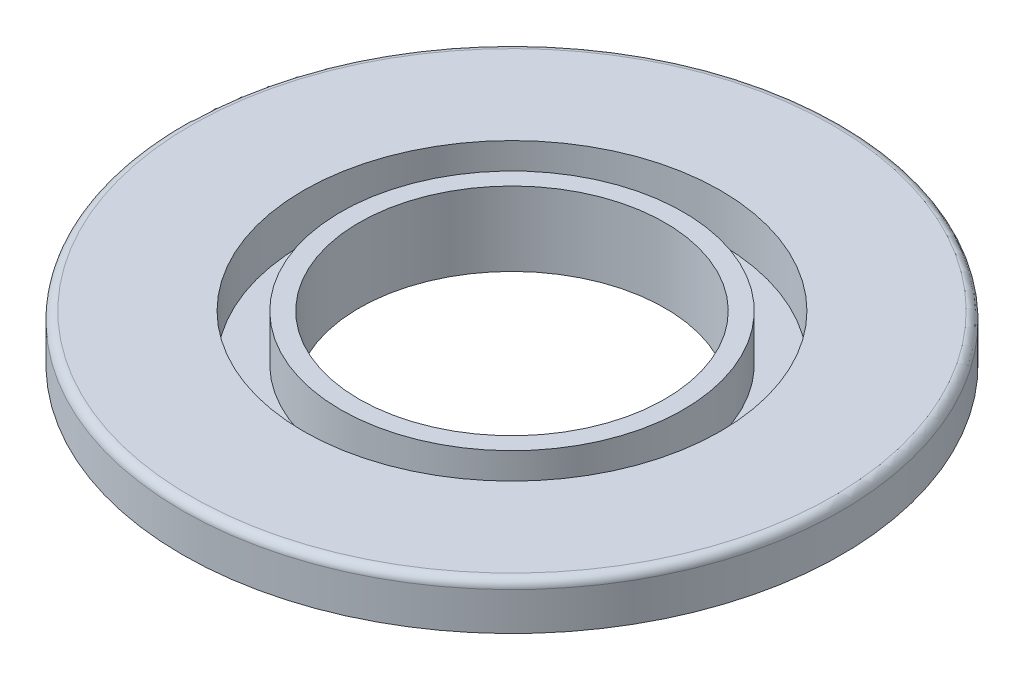
ISO-10303-21;
HEADER;
FILE_DESCRIPTION(('STEP AP214'),'2;1');
FILE_NAME('part.step','',(''),(''),'','','');
FILE_SCHEMA(('AUTOMOTIVE_DESIGN { 1 0 10303 214 1 1 1 1 }'));
ENDSEC;
DATA;
#1=APPLICATION_CONTEXT('core data for automotive mechanical design processes');
#2=APPLICATION_PROTOCOL_DEFINITION('international standard','automotive_design',2000,#1);
#3=PRODUCT_CONTEXT('',#1,'mechanical');
#4=PRODUCT('Part','Part','',(#3));
#5=PRODUCT_RELATED_PRODUCT_CATEGORY('part','',(#4));
#6=PRODUCT_DEFINITION_FORMATION('','',#4);
#7=PRODUCT_DEFINITION_CONTEXT('part definition',#1,'design');
#8=PRODUCT_DEFINITION('design','',#6,#7);
#9=PRODUCT_DEFINITION_SHAPE('','',#8);
#10=(LENGTH_UNIT() NAMED_UNIT(*) SI_UNIT(.MILLI.,.METRE.));
#11=(NAMED_UNIT(*) PLANE_ANGLE_UNIT() SI_UNIT($,.RADIAN.));
#12=(NAMED_UNIT(*) SI_UNIT($,.STERADIAN.) SOLID_ANGLE_UNIT());
#13=UNCERTAINTY_MEASURE_WITH_UNIT(LENGTH_MEASURE(1.E-05),#10,'distance_accuracy_value','');
#14=(GEOMETRIC_REPRESENTATION_CONTEXT(3) GLOBAL_UNCERTAINTY_ASSIGNED_CONTEXT((#13)) GLOBAL_UNIT_ASSIGNED_CONTEXT((#10,
#11,#12)) REPRESENTATION_CONTEXT('',''));
#15=CARTESIAN_POINT('',(0.,0.,0.));
#16=DIRECTION('',(0.,0.,1.));
#17=DIRECTION('',(1.,0.,0.));
#18=AXIS2_PLACEMENT_3D('',#15,#16,#17);
#19=CARTESIAN_POINT('',(-23.866050786552,40.6568697319389,0.));
#20=DIRECTION('',(0.,1.,0.));
#21=DIRECTION('',(0.,0.,1.));
#22=AXIS2_PLACEMENT_3D('',#19,#20,#21);
#23=CYLINDRICAL_SURFACE('',#22,47.9696878858064);
#24=CARTESIAN_POINT('',(-23.866050786552,31.2414300017496,0.));
#25=DIRECTION('',(0.,1.,0.));
#26=DIRECTION('',(0.,0.,1.));
#27=AXIS2_PLACEMENT_3D('',#24,#25,#26);
#28=CIRCLE('',#27,47.9696878858064);
#29=CARTESIAN_POINT('',(-23.866050786552,31.2414300017496,47.9696878858064));
#30=VERTEX_POINT('',#29);
#31=EDGE_CURVE('E107',#30,#30,#28,.T.);
#32=ORIENTED_EDGE('',*,*,#31,.F.);
#33=EDGE_LOOP('',(#32));
#34=FACE_BOUND('',#33,.T.);
#35=CARTESIAN_POINT('',(-23.866050786552,25.6578552780326,0.));
#36=DIRECTION('',(0.,1.,0.));
#37=DIRECTION('',(0.,0.,1.));
#38=AXIS2_PLACEMENT_3D('',#35,#36,#37);
#39=CIRCLE('',#38,47.9696878858064);
#40=CARTESIAN_POINT('',(-23.866050786552,25.6578552780326,47.9696878858064));
#41=VERTEX_POINT('',#40);
#42=EDGE_CURVE('E63',#41,#41,#39,.T.);
#43=ORIENTED_EDGE('',*,*,#42,.T.);
#44=EDGE_LOOP('',(#43));
#45=FACE_BOUND('',#44,.T.);
#46=ADVANCED_FACE('F39',(#34,#45),#23,.T.);
#47=CARTESIAN_POINT('',(0.,25.6578552780326,0.));
#48=DIRECTION('',(0.,1.,0.));
#49=DIRECTION('',(0.,0.,1.));
#50=AXIS2_PLACEMENT_3D('',#47,#48,#49);
#51=PLANE('',#50);
#52=ORIENTED_EDGE('',*,*,#42,.F.);
#53=EDGE_LOOP('',(#52));
#54=FACE_BOUND('',#53,.T.);
#55=CARTESIAN_POINT('',(-23.866050786552,25.6578552780326,0.));
#56=DIRECTION('',(0.,1.,0.));
#57=DIRECTION('',(0.,0.,1.));
#58=AXIS2_PLACEMENT_3D('',#55,#56,#57);
#59=CIRCLE('',#58,46.1084963112341);
#60=CARTESIAN_POINT('',(-23.866050786552,25.6578552780326,46.1084963112341));
#61=VERTEX_POINT('',#60);
#62=EDGE_CURVE('E67',#61,#61,#59,.T.);
#63=ORIENTED_EDGE('',*,*,#62,.T.);
#64=EDGE_LOOP('',(#63));
#65=FACE_BOUND('',#64,.T.);
#66=ADVANCED_FACE('F116',(#54,#65),#51,.F.);
#67=CARTESIAN_POINT('',(-23.866050786552,40.6568697319389,0.));
#68=DIRECTION('',(0.,1.,0.));
#69=DIRECTION('',(0.,0.,1.));
#70=AXIS2_PLACEMENT_3D('',#67,#68,#69);
#71=CYLINDRICAL_SURFACE('',#70,46.1084963112341);
#72=ORIENTED_EDGE('',*,*,#62,.F.);
#73=EDGE_LOOP('',(#72));
#74=FACE_BOUND('',#73,.T.);
#75=CARTESIAN_POINT('',(-23.866050786552,19.9647986969879,0.));
#76=DIRECTION('',(0.,1.,0.));
#77=DIRECTION('',(0.,0.,1.));
#78=AXIS2_PLACEMENT_3D('',#75,#76,#77);
#79=CIRCLE('',#78,46.1084963112341);
#80=CARTESIAN_POINT('',(-23.866050786552,19.9647986969879,46.1084963112341));
#81=VERTEX_POINT('',#80);
#82=EDGE_CURVE('E71',#81,#81,#79,.T.);
#83=ORIENTED_EDGE('',*,*,#82,.T.);
#84=EDGE_LOOP('',(#83));
#85=FACE_BOUND('',#84,.T.);
#86=ADVANCED_FACE('F122',(#74,#85),#71,.T.);
#87=CARTESIAN_POINT('',(0.,19.9647986969879,0.));
#88=DIRECTION('',(0.,1.,0.));
#89=DIRECTION('',(0.,0.,1.));
#90=AXIS2_PLACEMENT_3D('',#87,#88,#89);
#91=PLANE('',#90);
#92=ORIENTED_EDGE('',*,*,#82,.F.);
#93=EDGE_LOOP('',(#92));
#94=FACE_BOUND('',#93,.T.);
#95=CARTESIAN_POINT('',(-23.866050786552,19.9647986969879,0.));
#96=DIRECTION('',(0.,1.,0.));
#97=DIRECTION('',(0.,0.,1.));
#98=AXIS2_PLACEMENT_3D('',#95,#96,#97);
#99=CIRCLE('',#98,42.2766313047617);
#100=CARTESIAN_POINT('',(-23.866050786552,19.9647986969879,42.2766313047617));
#101=VERTEX_POINT('',#100);
#102=EDGE_CURVE('E75',#101,#101,#99,.T.);
#103=ORIENTED_EDGE('',*,*,#102,.T.);
#104=EDGE_LOOP('',(#103));
#105=FACE_BOUND('',#104,.T.);
#106=ADVANCED_FACE('F128',(#94,#105),#91,.F.);
#107=CARTESIAN_POINT('',(-23.866050786552,40.6568697319389,0.));
#108=DIRECTION('',(0.,1.,0.));
#109=DIRECTION('',(0.,0.,1.));
#110=AXIS2_PLACEMENT_3D('',#107,#108,#109);
#111=CYLINDRICAL_SURFACE('',#110,42.2766313047617);
#112=CARTESIAN_POINT('',(-23.866050786552,23.9578552780326,0.));
#113=DIRECTION('',(0.,1.,0.));
#114=DIRECTION('',(0.,0.,1.));
#115=AXIS2_PLACEMENT_3D('',#112,#113,#114);
#116=CIRCLE('',#115,42.2766313047617);
#117=CARTESIAN_POINT('',(-23.866050786552,23.9578552780326,42.2766313047617));
#118=VERTEX_POINT('',#117);
#119=EDGE_CURVE('E47',#118,#118,#116,.T.);
#120=ORIENTED_EDGE('',*,*,#119,.T.);
#121=EDGE_LOOP('',(#120));
#122=FACE_BOUND('',#121,.T.);
#123=ORIENTED_EDGE('',*,*,#102,.F.);
#124=EDGE_LOOP('',(#123));
#125=FACE_BOUND('',#124,.T.);
#126=ADVANCED_FACE('F134',(#122,#125),#111,.F.);
#127=CARTESIAN_POINT('',(0.,25.6578552780326,0.));
#128=DIRECTION('',(0.,1.,0.));
#129=DIRECTION('',(0.,0.,1.));
#130=AXIS2_PLACEMENT_3D('',#127,#128,#129);
#131=PLANE('',#130);
#132=CARTESIAN_POINT('',(-23.866050786552,25.6578552780326,0.));
#133=DIRECTION('',(0.,1.,0.));
#134=DIRECTION('',(0.,0.,1.));
#135=AXIS2_PLACEMENT_3D('',#132,#133,#134);
#136=CIRCLE('',#135,40.5766313047617);
#137=CARTESIAN_POINT('',(-23.866050786552,25.6578552780326,40.5766313047617));
#138=VERTEX_POINT('',#137);
#139=EDGE_CURVE('E10',#138,#138,#136,.F.);
#140=ORIENTED_EDGE('',*,*,#139,.T.);
#141=EDGE_LOOP('',(#140));
#142=FACE_BOUND('',#141,.T.);
#143=CARTESIAN_POINT('',(-23.866050786552,25.6578552780326,0.));
#144=DIRECTION('',(0.,1.,0.));
#145=DIRECTION('',(0.,0.,1.));
#146=AXIS2_PLACEMENT_3D('',#143,#144,#145);
#147=CIRCLE('',#146,31.);
#148=CARTESIAN_POINT('',(-23.866050786552,25.6578552780326,31.));
#149=VERTEX_POINT('',#148);
#150=EDGE_CURVE('E79',#149,#149,#147,.T.);
#151=ORIENTED_EDGE('',*,*,#150,.T.);
#152=EDGE_LOOP('',(#151));
#153=FACE_BOUND('',#152,.T.);
#154=ADVANCED_FACE('F139',(#142,#153),#131,.F.);
#155=CARTESIAN_POINT('',(-23.866050786552,40.6568697319389,0.));
#156=DIRECTION('',(0.,1.,0.));
#157=DIRECTION('',(0.,0.,1.));
#158=AXIS2_PLACEMENT_3D('',#155,#156,#157);
#159=CYLINDRICAL_SURFACE('',#158,31.);
#160=ORIENTED_EDGE('',*,*,#150,.F.);
#161=EDGE_LOOP('',(#160));
#162=FACE_BOUND('',#161,.T.);
#163=CARTESIAN_POINT('',(-23.866050786552,40.6568697319389,0.));
#164=DIRECTION('',(0.,1.,0.));
#165=DIRECTION('',(0.,0.,1.));
#166=AXIS2_PLACEMENT_3D('',#163,#164,#165);
#167=CIRCLE('',#166,31.);
#168=CARTESIAN_POINT('',(-23.866050786552,40.6568697319389,31.));
#169=VERTEX_POINT('',#168);
#170=EDGE_CURVE('E83',#169,#169,#167,.T.);
#171=ORIENTED_EDGE('',*,*,#170,.T.);
#172=EDGE_LOOP('',(#171));
#173=FACE_BOUND('',#172,.T.);
#174=ADVANCED_FACE('F144',(#162,#173),#159,.F.);
#175=CARTESIAN_POINT('',(0.,40.6568697319389,0.));
#176=DIRECTION('',(0.,-1.,0.));
#177=DIRECTION('',(0.,0.,-1.));
#178=AXIS2_PLACEMENT_3D('',#175,#176,#177);
#179=PLANE('',#178);
#180=ORIENTED_EDGE('',*,*,#170,.F.);
#181=EDGE_LOOP('',(#180));
#182=FACE_BOUND('',#181,.T.);
#183=CARTESIAN_POINT('',(-23.866050786552,40.6568697319389,0.));
#184=DIRECTION('',(0.,1.,0.));
#185=DIRECTION('',(0.,0.,1.));
#186=AXIS2_PLACEMENT_3D('',#183,#184,#185);
#187=CIRCLE('',#186,34.7223831491446);
#188=CARTESIAN_POINT('',(-23.866050786552,40.6568697319389,34.7223831491446));
#189=VERTEX_POINT('',#188);
#190=EDGE_CURVE('E87',#189,#189,#187,.T.);
#191=ORIENTED_EDGE('',*,*,#190,.T.);
#192=EDGE_LOOP('',(#191));
#193=FACE_BOUND('',#192,.T.);
#194=ADVANCED_FACE('F184',(#182,#193),#179,.F.);
#195=CARTESIAN_POINT('',(-23.866050786552,40.6568697319389,0.));
#196=DIRECTION('',(0.,1.,0.));
#197=DIRECTION('',(0.,0.,1.));
#198=AXIS2_PLACEMENT_3D('',#195,#196,#197);
#199=CYLINDRICAL_SURFACE('',#198,34.7223831491446);
#200=ORIENTED_EDGE('',*,*,#190,.F.);
#201=EDGE_LOOP('',(#200));
#202=FACE_BOUND('',#201,.T.);
#203=CARTESIAN_POINT('',(-23.866050786552,31.2414300017496,0.));
#204=DIRECTION('',(0.,1.,0.));
#205=DIRECTION('',(0.,0.,1.));
#206=AXIS2_PLACEMENT_3D('',#203,#204,#205);
#207=CIRCLE('',#206,34.7223831491446);
#208=CARTESIAN_POINT('',(-23.866050786552,31.2414300017496,34.7223831491446));
#209=VERTEX_POINT('',#208);
#210=EDGE_CURVE('E91',#209,#209,#207,.T.);
#211=ORIENTED_EDGE('',*,*,#210,.T.);
#212=EDGE_LOOP('',(#211));
#213=FACE_BOUND('',#212,.T.);
#214=ADVANCED_FACE('F176',(#202,#213),#199,.T.);
#215=CARTESIAN_POINT('',(0.,31.2414300017496,0.));
#216=DIRECTION('',(0.,-1.,0.));
#217=DIRECTION('',(0.,0.,-1.));
#218=AXIS2_PLACEMENT_3D('',#215,#216,#217);
#219=PLANE('',#218);
#220=ORIENTED_EDGE('',*,*,#210,.F.);
#221=EDGE_LOOP('',(#220));
#222=FACE_BOUND('',#221,.T.);
#223=CARTESIAN_POINT('',(-23.866050786552,31.2414300017496,0.));
#224=DIRECTION('',(0.,1.,0.));
#225=DIRECTION('',(0.,0.,1.));
#226=AXIS2_PLACEMENT_3D('',#223,#224,#225);
#227=CIRCLE('',#226,42.2766313047617);
#228=CARTESIAN_POINT('',(-23.866050786552,31.2414300017496,42.2766313047617));
#229=VERTEX_POINT('',#228);
#230=EDGE_CURVE('E95',#229,#229,#227,.T.);
#231=ORIENTED_EDGE('',*,*,#230,.T.);
#232=EDGE_LOOP('',(#231));
#233=FACE_BOUND('',#232,.T.);
#234=ADVANCED_FACE('F170',(#222,#233),#219,.F.);
#235=CARTESIAN_POINT('',(-23.866050786552,40.6568697319389,0.));
#236=DIRECTION('',(0.,1.,0.));
#237=DIRECTION('',(0.,0.,1.));
#238=AXIS2_PLACEMENT_3D('',#235,#236,#237);
#239=CYLINDRICAL_SURFACE('',#238,42.2766313047617);
#240=ORIENTED_EDGE('',*,*,#230,.F.);
#241=EDGE_LOOP('',(#240));
#242=FACE_BOUND('',#241,.T.);
#243=CARTESIAN_POINT('',(-23.866050786552,40.6568697319389,0.));
#244=DIRECTION('',(0.,1.,0.));
#245=DIRECTION('',(0.,0.,1.));
#246=AXIS2_PLACEMENT_3D('',#243,#244,#245);
#247=CIRCLE('',#246,42.2766313047617);
#248=CARTESIAN_POINT('',(-23.866050786552,40.6568697319389,42.2766313047617));
#249=VERTEX_POINT('',#248);
#250=EDGE_CURVE('E99',#249,#249,#247,.T.);
#251=ORIENTED_EDGE('',*,*,#250,.T.);
#252=EDGE_LOOP('',(#251));
#253=FACE_BOUND('',#252,.T.);
#254=ADVANCED_FACE('F165',(#242,#253),#239,.F.);
#255=CARTESIAN_POINT('',(0.,40.6568697319389,0.));
#256=DIRECTION('',(0.,-1.,0.));
#257=DIRECTION('',(0.,0.,-1.));
#258=AXIS2_PLACEMENT_3D('',#255,#256,#257);
#259=PLANE('',#258);
#260=CARTESIAN_POINT('',(-23.866050786552,40.6568697319389,0.));
#261=DIRECTION('',(0.,-1.,0.));
#262=DIRECTION('',(0.,0.,-1.));
#263=AXIS2_PLACEMENT_3D('',#260,#261,#262);
#264=CIRCLE('',#263,65.1005673461851);
#265=CARTESIAN_POINT('',(-23.866050786552,40.6568697319389,-65.1005673461851));
#266=VERTEX_POINT('',#265);
#267=EDGE_CURVE('E57',#266,#266,#264,.F.);
#268=ORIENTED_EDGE('',*,*,#267,.T.);
#269=EDGE_LOOP('',(#268));
#270=FACE_BOUND('',#269,.T.);
#271=ORIENTED_EDGE('',*,*,#250,.F.);
#272=EDGE_LOOP('',(#271));
#273=FACE_BOUND('',#272,.T.);
#274=ADVANCED_FACE('F162',(#270,#273),#259,.F.);
#275=CARTESIAN_POINT('',(-23.866050786552,40.6568697319389,0.));
#276=DIRECTION('',(0.,1.,0.));
#277=DIRECTION('',(0.,0.,1.));
#278=AXIS2_PLACEMENT_3D('',#275,#276,#277);
#279=CYLINDRICAL_SURFACE('',#278,66.8005673461851);
#280=CARTESIAN_POINT('',(-23.866050786552,38.9568697319389,0.));
#281=DIRECTION('',(0.,-1.,0.));
#282=DIRECTION('',(0.,0.,-1.));
#283=AXIS2_PLACEMENT_3D('',#280,#281,#282);
#284=CIRCLE('',#283,66.8005673461851);
#285=CARTESIAN_POINT('',(-23.866050786552,38.9568697319389,-66.8005673461851));
#286=VERTEX_POINT('',#285);
#287=EDGE_CURVE('E52',#286,#286,#284,.T.);
#288=ORIENTED_EDGE('',*,*,#287,.T.);
#289=EDGE_LOOP('',(#288));
#290=FACE_BOUND('',#289,.T.);
#291=CARTESIAN_POINT('',(-23.866050786552,31.2414300017496,0.));
#292=DIRECTION('',(0.,1.,0.));
#293=DIRECTION('',(0.,0.,1.));
#294=AXIS2_PLACEMENT_3D('',#291,#292,#293);
#295=CIRCLE('',#294,66.8005673461851);
#296=CARTESIAN_POINT('',(-23.866050786552,31.2414300017496,66.8005673461851));
#297=VERTEX_POINT('',#296);
#298=EDGE_CURVE('E103',#297,#297,#295,.T.);
#299=ORIENTED_EDGE('',*,*,#298,.T.);
#300=EDGE_LOOP('',(#299));
#301=FACE_BOUND('',#300,.T.);
#302=ADVANCED_FACE('F155',(#290,#301),#279,.T.);
#303=CARTESIAN_POINT('',(0.,31.2414300017496,0.));
#304=DIRECTION('',(0.,1.,0.));
#305=DIRECTION('',(0.,0.,1.));
#306=AXIS2_PLACEMENT_3D('',#303,#304,#305);
#307=PLANE('',#306);
#308=ORIENTED_EDGE('',*,*,#298,.F.);
#309=EDGE_LOOP('',(#308));
#310=FACE_BOUND('',#309,.T.);
#311=ORIENTED_EDGE('',*,*,#31,.T.);
#312=EDGE_LOOP('',(#311));
#313=FACE_BOUND('',#312,.T.);
#314=ADVANCED_FACE('F112',(#310,#313),#307,.F.);
#315=CARTESIAN_POINT('',(-23.866050786552,38.9568697319389,0.));
#316=DIRECTION('',(0.,-1.,0.));
#317=DIRECTION('',(0.,0.,-1.));
#318=AXIS2_PLACEMENT_3D('',#315,#316,#317);
#319=TOROIDAL_SURFACE('',#318,65.1005673461851,1.7);
#320=ORIENTED_EDGE('',*,*,#287,.F.);
#321=EDGE_LOOP('',(#320));
#322=FACE_BOUND('',#321,.T.);
#323=ORIENTED_EDGE('',*,*,#267,.F.);
#324=EDGE_LOOP('',(#323));
#325=FACE_BOUND('',#324,.T.);
#326=ADVANCED_FACE('F147',(#322,#325),#319,.T.);
#327=CARTESIAN_POINT('',(-23.866050786552,23.9578552780326,0.));
#328=DIRECTION('',(0.,1.,0.));
#329=DIRECTION('',(0.,0.,1.));
#330=AXIS2_PLACEMENT_3D('',#327,#328,#329);
#331=TOROIDAL_SURFACE('',#330,40.5766313047617,1.7);
#332=ORIENTED_EDGE('',*,*,#139,.F.);
#333=EDGE_LOOP('',(#332));
#334=FACE_BOUND('',#333,.T.);
#335=ORIENTED_EDGE('',*,*,#119,.F.);
#336=EDGE_LOOP('',(#335));
#337=FACE_BOUND('',#336,.T.);
#338=ADVANCED_FACE('F41',(#334,#337),#331,.F.);
#339=CLOSED_SHELL('',(#46,#66,#86,#106,#126,#154,#174,#194,#214,#234,#254,#274,#302,#314,#326,#338));
#340=MANIFOLD_SOLID_BREP('B2',#339);
#341=ADVANCED_BREP_SHAPE_REPRESENTATION('',(#18,#340),#14);
#342=SHAPE_DEFINITION_REPRESENTATION(#9,#341);
ENDSEC;
END-ISO-10303-21;
